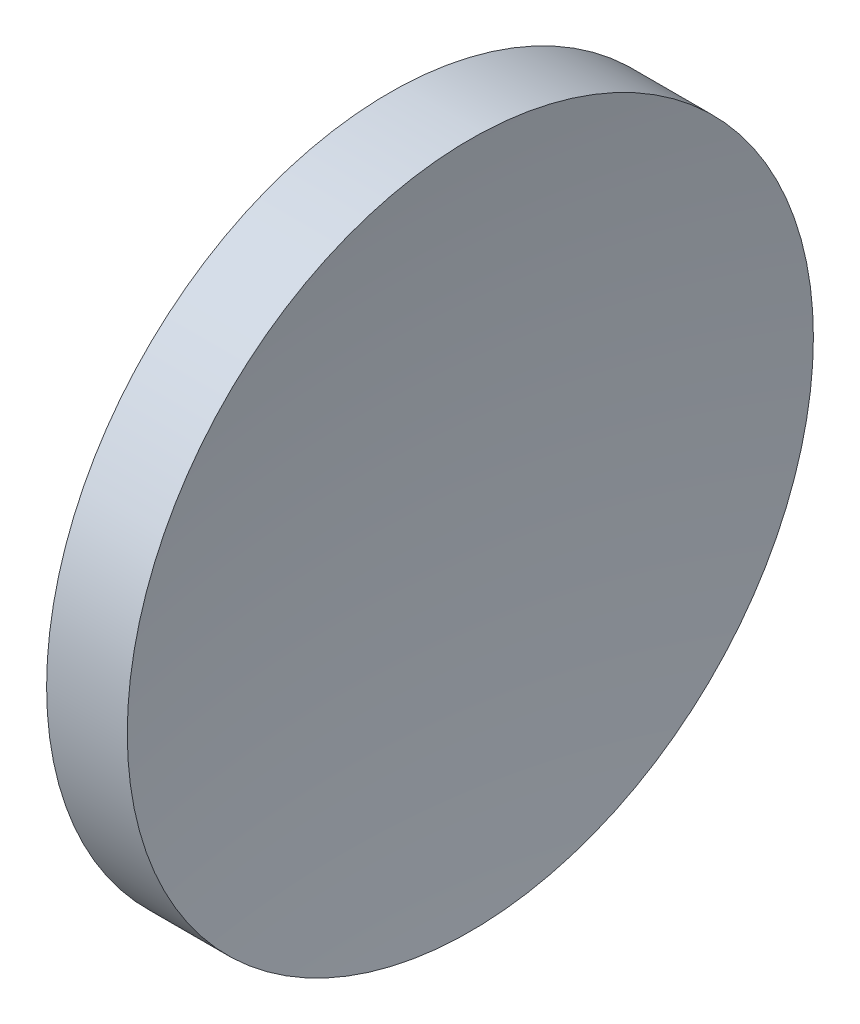
ISO-10303-21;
HEADER;
FILE_DESCRIPTION(('STEP AP214'),'2;1');
FILE_NAME('part.step','',(''),(''),'','','');
FILE_SCHEMA(('AUTOMOTIVE_DESIGN { 1 0 10303 214 1 1 1 1 }'));
ENDSEC;
DATA;
#1=APPLICATION_CONTEXT('core data for automotive mechanical design processes');
#2=APPLICATION_PROTOCOL_DEFINITION('international standard','automotive_design',2000,#1);
#3=PRODUCT_CONTEXT('',#1,'mechanical');
#4=PRODUCT('Part','Part','',(#3));
#5=PRODUCT_RELATED_PRODUCT_CATEGORY('part','',(#4));
#6=PRODUCT_DEFINITION_FORMATION('','',#4);
#7=PRODUCT_DEFINITION_CONTEXT('part definition',#1,'design');
#8=PRODUCT_DEFINITION('design','',#6,#7);
#9=PRODUCT_DEFINITION_SHAPE('','',#8);
#10=(LENGTH_UNIT() NAMED_UNIT(*) SI_UNIT(.MILLI.,.METRE.));
#11=(NAMED_UNIT(*) PLANE_ANGLE_UNIT() SI_UNIT($,.RADIAN.));
#12=(NAMED_UNIT(*) SI_UNIT($,.STERADIAN.) SOLID_ANGLE_UNIT());
#13=UNCERTAINTY_MEASURE_WITH_UNIT(LENGTH_MEASURE(1.E-05),#10,'distance_accuracy_value','');
#14=(GEOMETRIC_REPRESENTATION_CONTEXT(3) GLOBAL_UNCERTAINTY_ASSIGNED_CONTEXT((#13)) GLOBAL_UNIT_ASSIGNED_CONTEXT((#10,
#11,#12)) REPRESENTATION_CONTEXT('',''));
#15=CARTESIAN_POINT('',(0.,0.,0.));
#16=DIRECTION('',(0.,0.,1.));
#17=DIRECTION('',(1.,0.,0.));
#18=AXIS2_PLACEMENT_3D('',#15,#16,#17);
#19=CARTESIAN_POINT('',(142.15229964578,32.6107681292268,0.0786199039817595));
#20=DIRECTION('',(0.,-1.,0.));
#21=DIRECTION('',(0.,0.,1.));
#22=AXIS2_PLACEMENT_3D('',#19,#20,#21);
#23=CIRCLE('',#22,82.62);
#24=TRIMMED_CURVE('',#23,(PARAMETER_VALUE(-1.57174791134884)),
(PARAMETER_VALUE(1.57174791134884)),.T.,.PARAMETER.);
#25=CARTESIAN_POINT('',(142.15229964578,32.6107681292268,0.));
#26=DIRECTION('',(-1.,0.,0.));
#27=AXIS1_PLACEMENT('',#25,#26);
#28=SURFACE_OF_REVOLUTION('',#24,#27);
#29=CARTESIAN_POINT('',(60.4713733746473,32.6107681292268,0.));
#30=DIRECTION('',(-1.,0.,0.));
#31=DIRECTION('',(0.,0.,1.));
#32=AXIS2_PLACEMENT_3D('',#29,#30,#31);
#33=CIRCLE('',#32,12.5);
#34=CARTESIAN_POINT('',(60.4713733746473,32.6107681292268,12.5));
#35=VERTEX_POINT('',#34);
#36=EDGE_CURVE('E11',#35,#35,#33,.T.);
#37=ORIENTED_EDGE('',*,*,#36,.F.);
#38=EDGE_LOOP('',(#37));
#39=FACE_BOUND('',#38,.T.);
#40=CARTESIAN_POINT('',(59.5323370525261,32.6107681292268,0.));
#41=VERTEX_POINT('',#40);
#42=VERTEX_LOOP('',#41);
#43=FACE_BOUND('',#42,.T.);
#44=ADVANCED_FACE('F37',(#39,#43),#28,.F.);
#45=CARTESIAN_POINT('',(56.1009150799972,32.6107681292268,0.));
#46=DIRECTION('',(-1.,0.,0.));
#47=DIRECTION('',(0.,0.,1.));
#48=AXIS2_PLACEMENT_3D('',#45,#46,#47);
#49=CYLINDRICAL_SURFACE('',#48,12.5);
#50=CARTESIAN_POINT('',(57.5323370525261,32.6107681292268,0.));
#51=DIRECTION('',(-1.,0.,0.));
#52=DIRECTION('',(0.,0.,1.));
#53=AXIS2_PLACEMENT_3D('',#50,#51,#52);
#54=CIRCLE('',#53,12.5);
#55=CARTESIAN_POINT('',(57.5323370525261,32.6107681292268,12.5));
#56=VERTEX_POINT('',#55);
#57=EDGE_CURVE('E43',#56,#56,#54,.T.);
#58=ORIENTED_EDGE('',*,*,#57,.F.);
#59=EDGE_LOOP('',(#58));
#60=FACE_BOUND('',#59,.T.);
#61=ORIENTED_EDGE('',*,*,#36,.T.);
#62=EDGE_LOOP('',(#61));
#63=FACE_BOUND('',#62,.T.);
#64=ADVANCED_FACE('F47',(#60,#63),#49,.T.);
#65=CARTESIAN_POINT('',(57.5323370525261,32.6107681292268,0.));
#66=DIRECTION('',(1.,0.,0.));
#67=DIRECTION('',(0.,0.,-1.));
#68=AXIS2_PLACEMENT_3D('',#65,#66,#67);
#69=PLANE('',#68);
#70=ORIENTED_EDGE('',*,*,#57,.T.);
#71=EDGE_LOOP('',(#70));
#72=FACE_BOUND('',#71,.T.);
#73=ADVANCED_FACE('F52',(#72),#69,.F.);
#74=CLOSED_SHELL('',(#44,#64,#73));
#75=MANIFOLD_SOLID_BREP('B2',#74);
#76=ADVANCED_BREP_SHAPE_REPRESENTATION('',(#18,#75),#14);
#77=SHAPE_DEFINITION_REPRESENTATION(#9,#76);
ENDSEC;
END-ISO-10303-21;
